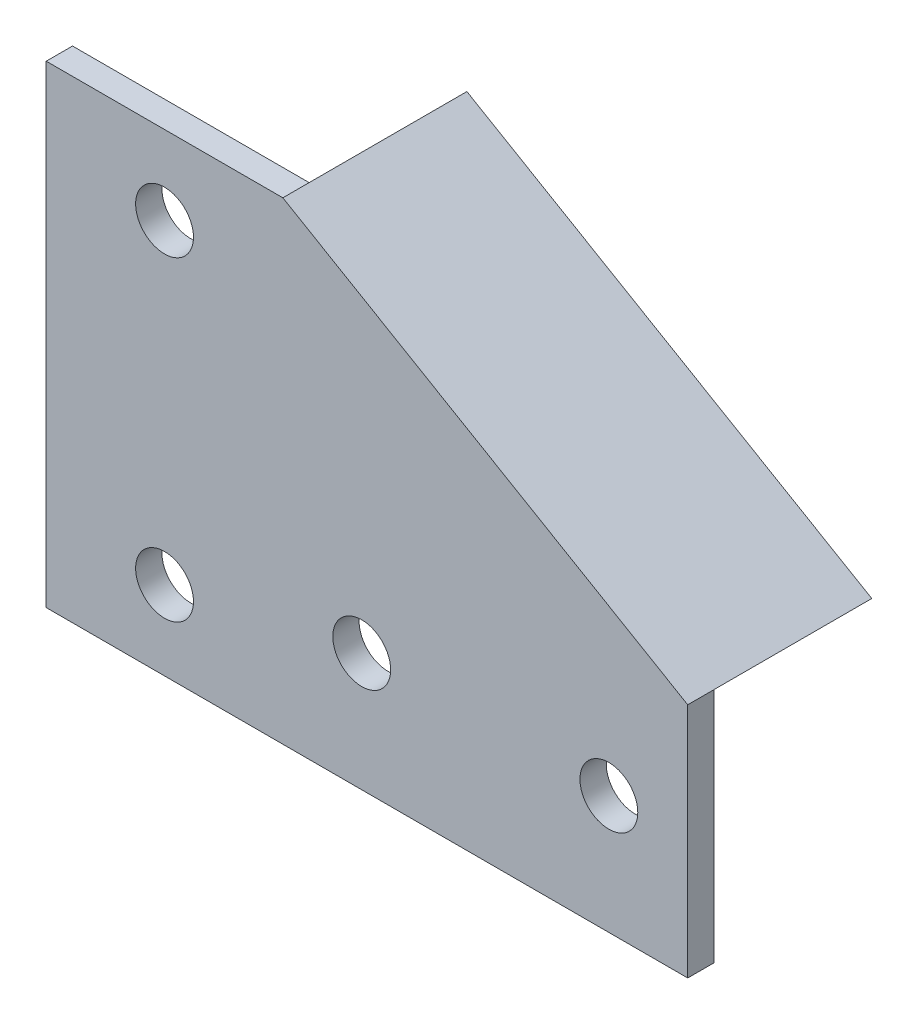
ISO-10303-21;
HEADER;
FILE_DESCRIPTION(('STEP AP214'),'2;1');
FILE_NAME('part.step','',(''),(''),'','','');
FILE_SCHEMA(('AUTOMOTIVE_DESIGN { 1 0 10303 214 1 1 1 1 }'));
ENDSEC;
DATA;
#1=APPLICATION_CONTEXT('core data for automotive mechanical design processes');
#2=APPLICATION_PROTOCOL_DEFINITION('international standard','automotive_design',2000,#1);
#3=PRODUCT_CONTEXT('',#1,'mechanical');
#4=PRODUCT('Part','Part','',(#3));
#5=PRODUCT_RELATED_PRODUCT_CATEGORY('part','',(#4));
#6=PRODUCT_DEFINITION_FORMATION('','',#4);
#7=PRODUCT_DEFINITION_CONTEXT('part definition',#1,'design');
#8=PRODUCT_DEFINITION('design','',#6,#7);
#9=PRODUCT_DEFINITION_SHAPE('','',#8);
#10=(LENGTH_UNIT() NAMED_UNIT(*) SI_UNIT(.MILLI.,.METRE.));
#11=(NAMED_UNIT(*) PLANE_ANGLE_UNIT() SI_UNIT($,.RADIAN.));
#12=(NAMED_UNIT(*) SI_UNIT($,.STERADIAN.) SOLID_ANGLE_UNIT());
#13=UNCERTAINTY_MEASURE_WITH_UNIT(LENGTH_MEASURE(1.E-05),#10,'distance_accuracy_value','');
#14=(GEOMETRIC_REPRESENTATION_CONTEXT(3) GLOBAL_UNCERTAINTY_ASSIGNED_CONTEXT((#13)) GLOBAL_UNIT_ASSIGNED_CONTEXT((#10,
#11,#12)) REPRESENTATION_CONTEXT('',''));
#15=CARTESIAN_POINT('',(0.,0.,0.));
#16=DIRECTION('',(0.,0.,1.));
#17=DIRECTION('',(1.,0.,0.));
#18=AXIS2_PLACEMENT_3D('',#15,#16,#17);
#19=CARTESIAN_POINT('',(0.,0.,0.));
#20=DIRECTION('',(0.,0.,-1.));
#21=DIRECTION('',(-1.,0.,0.));
#22=AXIS2_PLACEMENT_3D('',#19,#20,#21);
#23=PLANE('',#22);
#24=DIRECTION('',(0.,-1.,0.));
#25=VECTOR('',#24,1.);
#26=CARTESIAN_POINT('',(71.,27.5,0.));
#27=LINE('',#26,#25);
#28=CARTESIAN_POINT('',(71.,27.5,0.));
#29=VERTEX_POINT('',#28);
#30=CARTESIAN_POINT('',(71.,17.5,0.));
#31=VERTEX_POINT('',#30);
#32=EDGE_CURVE('E168',#29,#31,#27,.T.);
#33=ORIENTED_EDGE('',*,*,#32,.T.);
#34=DIRECTION('',(1.,0.,0.));
#35=VECTOR('',#34,1.);
#36=CARTESIAN_POINT('',(71.,17.5,0.));
#37=LINE('',#36,#35);
#38=CARTESIAN_POINT('',(96.,17.5,0.));
#39=VERTEX_POINT('',#38);
#40=EDGE_CURVE('E171',#31,#39,#37,.T.);
#41=ORIENTED_EDGE('',*,*,#40,.T.);
#42=DIRECTION('',(0.,1.,0.));
#43=VECTOR('',#42,1.);
#44=CARTESIAN_POINT('',(96.,27.5,0.));
#45=LINE('',#44,#43);
#46=CARTESIAN_POINT('',(96.,27.5,0.));
#47=VERTEX_POINT('',#46);
#48=EDGE_CURVE('E177',#39,#47,#45,.T.);
#49=ORIENTED_EDGE('',*,*,#48,.T.);
#50=DIRECTION('',(-1.,0.,0.));
#51=VECTOR('',#50,1.);
#52=CARTESIAN_POINT('',(71.,27.5,0.));
#53=LINE('',#52,#51);
#54=EDGE_CURVE('E179',#47,#29,#53,.T.);
#55=ORIENTED_EDGE('',*,*,#54,.T.);
#56=EDGE_LOOP('',(#33,#41,#49,#55));
#57=FACE_BOUND('',#56,.T.);
#58=DIRECTION('',(0.,-1.,0.));
#59=VECTOR('',#58,1.);
#60=CARTESIAN_POINT('',(17.5,64.,0.));
#61=LINE('',#60,#59);
#62=CARTESIAN_POINT('',(17.5,64.,0.));
#63=VERTEX_POINT('',#62);
#64=CARTESIAN_POINT('',(17.5,26.,0.));
#65=VERTEX_POINT('',#64);
#66=EDGE_CURVE('E182',#63,#65,#61,.T.);
#67=ORIENTED_EDGE('',*,*,#66,.T.);
#68=DIRECTION('',(1.,0.,0.));
#69=VECTOR('',#68,1.);
#70=CARTESIAN_POINT('',(17.5,26.,0.));
#71=LINE('',#70,#69);
#72=CARTESIAN_POINT('',(27.5,26.,0.));
#73=VERTEX_POINT('',#72);
#74=EDGE_CURVE('E184',#65,#73,#71,.T.);
#75=ORIENTED_EDGE('',*,*,#74,.T.);
#76=DIRECTION('',(0.,1.,0.));
#77=VECTOR('',#76,1.);
#78=CARTESIAN_POINT('',(27.5,64.,0.));
#79=LINE('',#78,#77);
#80=CARTESIAN_POINT('',(27.5,64.,0.));
#81=VERTEX_POINT('',#80);
#82=EDGE_CURVE('E187',#73,#81,#79,.T.);
#83=ORIENTED_EDGE('',*,*,#82,.T.);
#84=DIRECTION('',(-1.,0.,0.));
#85=VECTOR('',#84,1.);
#86=CARTESIAN_POINT('',(17.5,64.,0.));
#87=LINE('',#86,#85);
#88=EDGE_CURVE('E189',#81,#63,#87,.T.);
#89=ORIENTED_EDGE('',*,*,#88,.T.);
#90=EDGE_LOOP('',(#67,#75,#83,#89));
#91=FACE_BOUND('',#90,.T.);
#92=CARTESIAN_POINT('',(107.,22.5,0.));
#93=DIRECTION('',(0.,0.,1.));
#94=DIRECTION('',(1.,0.,0.));
#95=AXIS2_PLACEMENT_3D('',#92,#93,#94);
#96=CIRCLE('',#95,5.5);
#97=CARTESIAN_POINT('',(112.5,22.5,0.));
#98=VERTEX_POINT('',#97);
#99=EDGE_CURVE('E195',#98,#98,#96,.T.);
#100=ORIENTED_EDGE('',*,*,#99,.T.);
#101=EDGE_LOOP('',(#100));
#102=FACE_BOUND('',#101,.T.);
#103=CARTESIAN_POINT('',(22.5,75.,0.));
#104=DIRECTION('',(0.,0.,1.));
#105=DIRECTION('',(1.,0.,0.));
#106=AXIS2_PLACEMENT_3D('',#103,#104,#105);
#107=CIRCLE('',#106,5.5);
#108=CARTESIAN_POINT('',(28.,75.,0.));
#109=VERTEX_POINT('',#108);
#110=EDGE_CURVE('E209',#109,#109,#107,.T.);
#111=ORIENTED_EDGE('',*,*,#110,.T.);
#112=EDGE_LOOP('',(#111));
#113=FACE_BOUND('',#112,.T.);
#114=CARTESIAN_POINT('',(22.5,15.,0.));
#115=DIRECTION('',(0.,0.,1.));
#116=DIRECTION('',(1.,0.,0.));
#117=AXIS2_PLACEMENT_3D('',#114,#115,#116);
#118=CIRCLE('',#117,5.5);
#119=CARTESIAN_POINT('',(28.,15.,0.));
#120=VERTEX_POINT('',#119);
#121=EDGE_CURVE('E203',#120,#120,#118,.T.);
#122=ORIENTED_EDGE('',*,*,#121,.T.);
#123=EDGE_LOOP('',(#122));
#124=FACE_BOUND('',#123,.T.);
#125=CARTESIAN_POINT('',(60.,22.5,0.));
#126=DIRECTION('',(0.,0.,1.));
#127=DIRECTION('',(1.,0.,0.));
#128=AXIS2_PLACEMENT_3D('',#125,#126,#127);
#129=CIRCLE('',#128,5.49999999999999);
#130=CARTESIAN_POINT('',(65.5,22.5,0.));
#131=VERTEX_POINT('',#130);
#132=EDGE_CURVE('E196',#131,#131,#129,.T.);
#133=ORIENTED_EDGE('',*,*,#132,.T.);
#134=EDGE_LOOP('',(#133));
#135=FACE_BOUND('',#134,.T.);
#136=DIRECTION('',(0.,1.,0.));
#137=VECTOR('',#136,1.);
#138=CARTESIAN_POINT('',(45.,45.,0.));
#139=LINE('',#138,#137);
#140=CARTESIAN_POINT('',(45.,50.,0.));
#141=VERTEX_POINT('',#140);
#142=CARTESIAN_POINT('',(45.,90.,0.));
#143=VERTEX_POINT('',#142);
#144=EDGE_CURVE('E161',#141,#143,#139,.T.);
#145=ORIENTED_EDGE('',*,*,#144,.F.);
#146=DIRECTION('',(-0.707106781186551,0.707106781186544,0.));
#147=VECTOR('',#146,1.);
#148=CARTESIAN_POINT('',(45.,50.,0.));
#149=LINE('',#148,#147);
#150=CARTESIAN_POINT('',(50.0000000000001,45.,0.));
#151=VERTEX_POINT('',#150);
#152=EDGE_CURVE('E11',#141,#151,#149,.F.);
#153=ORIENTED_EDGE('',*,*,#152,.T.);
#154=DIRECTION('',(-1.,0.,0.));
#155=VECTOR('',#154,1.);
#156=CARTESIAN_POINT('',(122.,45.,0.));
#157=LINE('',#156,#155);
#158=CARTESIAN_POINT('',(122.,45.,0.));
#159=VERTEX_POINT('',#158);
#160=EDGE_CURVE('E415',#159,#151,#157,.T.);
#161=ORIENTED_EDGE('',*,*,#160,.F.);
#162=DIRECTION('',(0.,1.,0.));
#163=VECTOR('',#162,1.);
#164=CARTESIAN_POINT('',(122.,45.,0.));
#165=LINE('',#164,#163);
#166=CARTESIAN_POINT('',(122.,0.,0.));
#167=VERTEX_POINT('',#166);
#168=EDGE_CURVE('E233',#167,#159,#165,.T.);
#169=ORIENTED_EDGE('',*,*,#168,.F.);
#170=DIRECTION('',(1.,0.,0.));
#171=VECTOR('',#170,1.);
#172=CARTESIAN_POINT('',(122.,0.,0.));
#173=LINE('',#172,#171);
#174=CARTESIAN_POINT('',(0.,0.,0.));
#175=VERTEX_POINT('',#174);
#176=EDGE_CURVE('E215',#175,#167,#173,.T.);
#177=ORIENTED_EDGE('',*,*,#176,.F.);
#178=DIRECTION('',(0.,-1.,0.));
#179=VECTOR('',#178,1.);
#180=CARTESIAN_POINT('',(0.,0.,0.));
#181=LINE('',#180,#179);
#182=CARTESIAN_POINT('',(0.,90.,0.));
#183=VERTEX_POINT('',#182);
#184=EDGE_CURVE('E222',#183,#175,#181,.T.);
#185=ORIENTED_EDGE('',*,*,#184,.F.);
#186=DIRECTION('',(-1.,0.,0.));
#187=VECTOR('',#186,1.);
#188=CARTESIAN_POINT('',(0.,90.,0.));
#189=LINE('',#188,#187);
#190=EDGE_CURVE('E236',#143,#183,#189,.T.);
#191=ORIENTED_EDGE('',*,*,#190,.F.);
#192=EDGE_LOOP('',(#145,#153,#161,#169,#177,#185,#191));
#193=FACE_BOUND('',#192,.T.);
#194=ADVANCED_FACE('F35',(#57,#91,#102,#113,#124,#135,#193),#23,.T.);
#195=CARTESIAN_POINT('',(0.,0.,5.));
#196=DIRECTION('',(0.,0.,-1.));
#197=DIRECTION('',(-1.,0.,0.));
#198=AXIS2_PLACEMENT_3D('',#195,#196,#197);
#199=PLANE('',#198);
#200=DIRECTION('',(1.,0.,0.));
#201=VECTOR('',#200,1.);
#202=CARTESIAN_POINT('',(122.,0.,5.));
#203=LINE('',#202,#201);
#204=CARTESIAN_POINT('',(0.,0.,5.));
#205=VERTEX_POINT('',#204);
#206=CARTESIAN_POINT('',(122.,0.,5.));
#207=VERTEX_POINT('',#206);
#208=EDGE_CURVE('E218',#205,#207,#203,.T.);
#209=ORIENTED_EDGE('',*,*,#208,.T.);
#210=DIRECTION('',(0.,1.,0.));
#211=VECTOR('',#210,1.);
#212=CARTESIAN_POINT('',(122.,45.,5.));
#213=LINE('',#212,#211);
#214=CARTESIAN_POINT('',(122.,45.,5.));
#215=VERTEX_POINT('',#214);
#216=EDGE_CURVE('E221',#207,#215,#213,.T.);
#217=ORIENTED_EDGE('',*,*,#216,.T.);
#218=DIRECTION('',(-0.863371944126605,0.504568019294769,0.));
#219=VECTOR('',#218,1.);
#220=CARTESIAN_POINT('',(45.,90.,5.));
#221=LINE('',#220,#219);
#222=CARTESIAN_POINT('',(45.,90.,5.));
#223=VERTEX_POINT('',#222);
#224=EDGE_CURVE('E224',#215,#223,#221,.T.);
#225=ORIENTED_EDGE('',*,*,#224,.T.);
#226=DIRECTION('',(-1.,0.,0.));
#227=VECTOR('',#226,1.);
#228=CARTESIAN_POINT('',(0.,90.,5.));
#229=LINE('',#228,#227);
#230=CARTESIAN_POINT('',(0.,90.,5.));
#231=VERTEX_POINT('',#230);
#232=EDGE_CURVE('E226',#223,#231,#229,.T.);
#233=ORIENTED_EDGE('',*,*,#232,.T.);
#234=DIRECTION('',(0.,-1.,0.));
#235=VECTOR('',#234,1.);
#236=CARTESIAN_POINT('',(0.,0.,5.));
#237=LINE('',#236,#235);
#238=EDGE_CURVE('E228',#231,#205,#237,.T.);
#239=ORIENTED_EDGE('',*,*,#238,.T.);
#240=EDGE_LOOP('',(#209,#217,#225,#233,#239));
#241=FACE_BOUND('',#240,.T.);
#242=CARTESIAN_POINT('',(22.5,75.,5.));
#243=DIRECTION('',(0.,0.,1.));
#244=DIRECTION('',(1.,0.,0.));
#245=AXIS2_PLACEMENT_3D('',#242,#243,#244);
#246=CIRCLE('',#245,5.5);
#247=CARTESIAN_POINT('',(28.,75.,5.));
#248=VERTEX_POINT('',#247);
#249=EDGE_CURVE('E212',#248,#248,#246,.T.);
#250=ORIENTED_EDGE('',*,*,#249,.F.);
#251=EDGE_LOOP('',(#250));
#252=FACE_BOUND('',#251,.T.);
#253=CARTESIAN_POINT('',(22.5,15.,5.));
#254=DIRECTION('',(0.,0.,1.));
#255=DIRECTION('',(1.,0.,0.));
#256=AXIS2_PLACEMENT_3D('',#253,#254,#255);
#257=CIRCLE('',#256,5.5);
#258=CARTESIAN_POINT('',(28.,15.,5.));
#259=VERTEX_POINT('',#258);
#260=EDGE_CURVE('E206',#259,#259,#257,.T.);
#261=ORIENTED_EDGE('',*,*,#260,.F.);
#262=EDGE_LOOP('',(#261));
#263=FACE_BOUND('',#262,.T.);
#264=CARTESIAN_POINT('',(107.,22.5,5.));
#265=DIRECTION('',(0.,0.,1.));
#266=DIRECTION('',(1.,0.,0.));
#267=AXIS2_PLACEMENT_3D('',#264,#265,#266);
#268=CIRCLE('',#267,5.5);
#269=CARTESIAN_POINT('',(112.5,22.5,5.));
#270=VERTEX_POINT('',#269);
#271=EDGE_CURVE('E200',#270,#270,#268,.T.);
#272=ORIENTED_EDGE('',*,*,#271,.F.);
#273=EDGE_LOOP('',(#272));
#274=FACE_BOUND('',#273,.T.);
#275=CARTESIAN_POINT('',(60.,22.5,5.));
#276=DIRECTION('',(0.,0.,1.));
#277=DIRECTION('',(1.,0.,0.));
#278=AXIS2_PLACEMENT_3D('',#275,#276,#277);
#279=CIRCLE('',#278,5.49999999999999);
#280=CARTESIAN_POINT('',(65.5,22.5,5.));
#281=VERTEX_POINT('',#280);
#282=EDGE_CURVE('E192',#281,#281,#279,.T.);
#283=ORIENTED_EDGE('',*,*,#282,.F.);
#284=EDGE_LOOP('',(#283));
#285=FACE_BOUND('',#284,.T.);
#286=ADVANCED_FACE('F309',(#241,#252,#263,#274,#285),#199,.F.);
#287=CARTESIAN_POINT('',(122.,0.,5.));
#288=DIRECTION('',(0.,1.,0.));
#289=DIRECTION('',(-1.,0.,0.));
#290=AXIS2_PLACEMENT_3D('',#287,#288,#289);
#291=PLANE('',#290);
#292=ORIENTED_EDGE('',*,*,#176,.T.);
#293=DIRECTION('',(0.,0.,-1.));
#294=VECTOR('',#293,1.);
#295=CARTESIAN_POINT('',(122.,0.,5.));
#296=LINE('',#295,#294);
#297=EDGE_CURVE('E248',#207,#167,#296,.T.);
#298=ORIENTED_EDGE('',*,*,#297,.F.);
#299=ORIENTED_EDGE('',*,*,#208,.F.);
#300=DIRECTION('',(0.,0.,-1.));
#301=VECTOR('',#300,1.);
#302=CARTESIAN_POINT('',(0.,0.,5.));
#303=LINE('',#302,#301);
#304=EDGE_CURVE('E230',#205,#175,#303,.T.);
#305=ORIENTED_EDGE('',*,*,#304,.T.);
#306=EDGE_LOOP('',(#292,#298,#299,#305));
#307=FACE_BOUND('',#306,.T.);
#308=ADVANCED_FACE('F315',(#307),#291,.F.);
#309=CARTESIAN_POINT('',(122.,45.,5.));
#310=DIRECTION('',(-1.,0.,0.));
#311=DIRECTION('',(0.,0.,1.));
#312=AXIS2_PLACEMENT_3D('',#309,#310,#311);
#313=PLANE('',#312);
#314=ORIENTED_EDGE('',*,*,#168,.T.);
#315=DIRECTION('',(0.,0.,-1.));
#316=VECTOR('',#315,1.);
#317=CARTESIAN_POINT('',(122.,45.,5.));
#318=LINE('',#317,#316);
#319=EDGE_CURVE('E167',#215,#159,#318,.T.);
#320=ORIENTED_EDGE('',*,*,#319,.F.);
#321=ORIENTED_EDGE('',*,*,#216,.F.);
#322=ORIENTED_EDGE('',*,*,#297,.T.);
#323=EDGE_LOOP('',(#314,#320,#321,#322));
#324=FACE_BOUND('',#323,.T.);
#325=ADVANCED_FACE('F332',(#324),#313,.F.);
#326=CARTESIAN_POINT('',(45.,90.,5.));
#327=DIRECTION('',(-0.504568019294769,-0.863371944126605,0.));
#328=DIRECTION('',(0.863371944126605,-0.504568019294769,0.));
#329=AXIS2_PLACEMENT_3D('',#326,#327,#328);
#330=PLANE('',#329);
#331=ORIENTED_EDGE('',*,*,#319,.T.);
#332=DIRECTION('',(0.,0.,1.));
#333=VECTOR('',#332,1.);
#334=CARTESIAN_POINT('',(122.,45.,-30.));
#335=LINE('',#334,#333);
#336=CARTESIAN_POINT('',(122.,45.,-30.));
#337=VERTEX_POINT('',#336);
#338=EDGE_CURVE('E149',#337,#159,#335,.T.);
#339=ORIENTED_EDGE('',*,*,#338,.F.);
#340=DIRECTION('',(0.863371944126605,-0.504568019294769,0.));
#341=VECTOR('',#340,1.);
#342=CARTESIAN_POINT('',(45.,90.,-30.));
#343=LINE('',#342,#341);
#344=CARTESIAN_POINT('',(45.,90.,-30.));
#345=VERTEX_POINT('',#344);
#346=EDGE_CURVE('E153',#345,#337,#343,.T.);
#347=ORIENTED_EDGE('',*,*,#346,.F.);
#348=DIRECTION('',(0.,0.,1.));
#349=VECTOR('',#348,1.);
#350=CARTESIAN_POINT('',(45.,90.,-30.));
#351=LINE('',#350,#349);
#352=EDGE_CURVE('E169',#345,#143,#351,.T.);
#353=ORIENTED_EDGE('',*,*,#352,.T.);
#354=DIRECTION('',(0.,0.,-1.));
#355=VECTOR('',#354,1.);
#356=CARTESIAN_POINT('',(45.,90.,5.));
#357=LINE('',#356,#355);
#358=EDGE_CURVE('E244',#223,#143,#357,.T.);
#359=ORIENTED_EDGE('',*,*,#358,.F.);
#360=ORIENTED_EDGE('',*,*,#224,.F.);
#361=EDGE_LOOP('',(#331,#339,#347,#353,#359,#360));
#362=FACE_BOUND('',#361,.T.);
#363=ADVANCED_FACE('F164',(#362),#330,.F.);
#364=CARTESIAN_POINT('',(0.,90.,5.));
#365=DIRECTION('',(0.,-1.,0.));
#366=DIRECTION('',(0.,0.,-1.));
#367=AXIS2_PLACEMENT_3D('',#364,#365,#366);
#368=PLANE('',#367);
#369=ORIENTED_EDGE('',*,*,#190,.T.);
#370=DIRECTION('',(0.,0.,-1.));
#371=VECTOR('',#370,1.);
#372=CARTESIAN_POINT('',(0.,90.,5.));
#373=LINE('',#372,#371);
#374=EDGE_CURVE('E241',#231,#183,#373,.T.);
#375=ORIENTED_EDGE('',*,*,#374,.F.);
#376=ORIENTED_EDGE('',*,*,#232,.F.);
#377=ORIENTED_EDGE('',*,*,#358,.T.);
#378=EDGE_LOOP('',(#369,#375,#376,#377));
#379=FACE_BOUND('',#378,.T.);
#380=ADVANCED_FACE('F325',(#379),#368,.F.);
#381=CARTESIAN_POINT('',(0.,0.,5.));
#382=DIRECTION('',(1.,0.,0.));
#383=DIRECTION('',(0.,0.,-1.));
#384=AXIS2_PLACEMENT_3D('',#381,#382,#383);
#385=PLANE('',#384);
#386=ORIENTED_EDGE('',*,*,#184,.T.);
#387=ORIENTED_EDGE('',*,*,#304,.F.);
#388=ORIENTED_EDGE('',*,*,#238,.F.);
#389=ORIENTED_EDGE('',*,*,#374,.T.);
#390=EDGE_LOOP('',(#386,#387,#388,#389));
#391=FACE_BOUND('',#390,.T.);
#392=ADVANCED_FACE('F321',(#391),#385,.F.);
#393=CARTESIAN_POINT('',(22.5,75.,5.));
#394=DIRECTION('',(0.,0.,-1.));
#395=DIRECTION('',(-1.,0.,0.));
#396=AXIS2_PLACEMENT_3D('',#393,#394,#395);
#397=CYLINDRICAL_SURFACE('',#396,5.5);
#398=ORIENTED_EDGE('',*,*,#249,.T.);
#399=EDGE_LOOP('',(#398));
#400=FACE_BOUND('',#399,.T.);
#401=ORIENTED_EDGE('',*,*,#110,.F.);
#402=EDGE_LOOP('',(#401));
#403=FACE_BOUND('',#402,.T.);
#404=ADVANCED_FACE('F324',(#400,#403),#397,.F.);
#405=CARTESIAN_POINT('',(22.5,15.,5.));
#406=DIRECTION('',(0.,0.,-1.));
#407=DIRECTION('',(-1.,0.,0.));
#408=AXIS2_PLACEMENT_3D('',#405,#406,#407);
#409=CYLINDRICAL_SURFACE('',#408,5.5);
#410=ORIENTED_EDGE('',*,*,#260,.T.);
#411=EDGE_LOOP('',(#410));
#412=FACE_BOUND('',#411,.T.);
#413=ORIENTED_EDGE('',*,*,#121,.F.);
#414=EDGE_LOOP('',(#413));
#415=FACE_BOUND('',#414,.T.);
#416=ADVANCED_FACE('F397',(#412,#415),#409,.F.);
#417=CARTESIAN_POINT('',(107.,22.5,5.));
#418=DIRECTION('',(0.,0.,-1.));
#419=DIRECTION('',(-1.,0.,0.));
#420=AXIS2_PLACEMENT_3D('',#417,#418,#419);
#421=CYLINDRICAL_SURFACE('',#420,5.5);
#422=ORIENTED_EDGE('',*,*,#271,.T.);
#423=EDGE_LOOP('',(#422));
#424=FACE_BOUND('',#423,.T.);
#425=ORIENTED_EDGE('',*,*,#99,.F.);
#426=EDGE_LOOP('',(#425));
#427=FACE_BOUND('',#426,.T.);
#428=ADVANCED_FACE('F375',(#424,#427),#421,.F.);
#429=CARTESIAN_POINT('',(60.,22.5,5.));
#430=DIRECTION('',(0.,0.,-1.));
#431=DIRECTION('',(-1.,0.,0.));
#432=AXIS2_PLACEMENT_3D('',#429,#430,#431);
#433=CYLINDRICAL_SURFACE('',#432,5.49999999999999);
#434=ORIENTED_EDGE('',*,*,#282,.T.);
#435=EDGE_LOOP('',(#434));
#436=FACE_BOUND('',#435,.T.);
#437=ORIENTED_EDGE('',*,*,#132,.F.);
#438=EDGE_LOOP('',(#437));
#439=FACE_BOUND('',#438,.T.);
#440=ADVANCED_FACE('F370',(#436,#439),#433,.F.);
#441=CARTESIAN_POINT('',(17.5,64.,0.));
#442=DIRECTION('',(-0.984807753012208,0.,-0.173648177666931));
#443=DIRECTION('',(-0.173648177666931,0.,0.984807753012208));
#444=AXIS2_PLACEMENT_3D('',#441,#442,#443);
#445=PLANE('',#444);
#446=ORIENTED_EDGE('',*,*,#66,.F.);
#447=DIRECTION('',(-0.171087869746036,0.171087869746036,0.970287525247814));
#448=VECTOR('',#447,1.);
#449=CARTESIAN_POINT('',(17.5,64.,0.));
#450=LINE('',#449,#448);
#451=CARTESIAN_POINT('',(18.5579618842508,62.9420381157492,-6.));
#452=VERTEX_POINT('',#451);
#453=EDGE_CURVE('E199',#452,#63,#450,.T.);
#454=ORIENTED_EDGE('',*,*,#453,.F.);
#455=DIRECTION('',(0.,-1.,0.));
#456=VECTOR('',#455,1.);
#457=CARTESIAN_POINT('',(18.5579618842508,0.,-6.));
#458=LINE('',#457,#456);
#459=CARTESIAN_POINT('',(18.5579618842508,27.0579618842508,-6.));
#460=VERTEX_POINT('',#459);
#461=EDGE_CURVE('E191',#452,#460,#458,.T.);
#462=ORIENTED_EDGE('',*,*,#461,.T.);
#463=DIRECTION('',(-0.171087869746036,-0.171087869746036,0.970287525247814));
#464=VECTOR('',#463,1.);
#465=CARTESIAN_POINT('',(18.612300248621,27.112300248621,-6.30816817796045));
#466=LINE('',#465,#464);
#467=EDGE_CURVE('E274',#460,#65,#466,.T.);
#468=ORIENTED_EDGE('',*,*,#467,.T.);
#469=EDGE_LOOP('',(#446,#454,#462,#468));
#470=FACE_BOUND('',#469,.T.);
#471=ADVANCED_FACE('F367',(#470),#445,.T.);
#472=CARTESIAN_POINT('',(17.5,64.,0.));
#473=DIRECTION('',(0.,0.984807753012208,-0.173648177666931));
#474=DIRECTION('',(0.,0.173648177666931,0.984807753012208));
#475=AXIS2_PLACEMENT_3D('',#472,#473,#474);
#476=PLANE('',#475);
#477=ORIENTED_EDGE('',*,*,#88,.F.);
#478=DIRECTION('',(0.171087869746036,0.171087869746036,0.970287525247814));
#479=VECTOR('',#478,1.);
#480=CARTESIAN_POINT('',(27.5,64.,0.));
#481=LINE('',#480,#479);
#482=CARTESIAN_POINT('',(26.4420381157492,62.9420381157492,-6.));
#483=VERTEX_POINT('',#482);
#484=EDGE_CURVE('E281',#483,#81,#481,.T.);
#485=ORIENTED_EDGE('',*,*,#484,.F.);
#486=DIRECTION('',(-1.,0.,0.));
#487=VECTOR('',#486,1.);
#488=CARTESIAN_POINT('',(0.,62.9420381157492,-6.));
#489=LINE('',#488,#487);
#490=EDGE_CURVE('E278',#483,#452,#489,.T.);
#491=ORIENTED_EDGE('',*,*,#490,.T.);
#492=ORIENTED_EDGE('',*,*,#453,.T.);
#493=EDGE_LOOP('',(#477,#485,#491,#492));
#494=FACE_BOUND('',#493,.T.);
#495=ADVANCED_FACE('F364',(#494),#476,.T.);
#496=CARTESIAN_POINT('',(27.5,64.,0.));
#497=DIRECTION('',(0.984807753012208,0.,-0.173648177666931));
#498=DIRECTION('',(-0.173648177666931,0.,-0.984807753012208));
#499=AXIS2_PLACEMENT_3D('',#496,#497,#498);
#500=PLANE('',#499);
#501=ORIENTED_EDGE('',*,*,#82,.F.);
#502=DIRECTION('',(0.171087869746036,-0.171087869746036,0.970287525247814));
#503=VECTOR('',#502,1.);
#504=CARTESIAN_POINT('',(27.2072894082576,26.2927105917423,-1.66004425735802));
#505=LINE('',#504,#503);
#506=CARTESIAN_POINT('',(26.4420381157492,27.0579618842508,-6.));
#507=VERTEX_POINT('',#506);
#508=EDGE_CURVE('E277',#507,#73,#505,.T.);
#509=ORIENTED_EDGE('',*,*,#508,.F.);
#510=DIRECTION('',(0.,1.,0.));
#511=VECTOR('',#510,1.);
#512=CARTESIAN_POINT('',(26.4420381157492,0.,-6.));
#513=LINE('',#512,#511);
#514=EDGE_CURVE('E289',#507,#483,#513,.T.);
#515=ORIENTED_EDGE('',*,*,#514,.T.);
#516=ORIENTED_EDGE('',*,*,#484,.T.);
#517=EDGE_LOOP('',(#501,#509,#515,#516));
#518=FACE_BOUND('',#517,.T.);
#519=ADVANCED_FACE('F360',(#518),#500,.T.);
#520=CARTESIAN_POINT('',(17.5,26.,0.));
#521=DIRECTION('',(0.,-0.984807753012208,-0.173648177666931));
#522=DIRECTION('',(0.,0.173648177666931,-0.984807753012208));
#523=AXIS2_PLACEMENT_3D('',#520,#521,#522);
#524=PLANE('',#523);
#525=ORIENTED_EDGE('',*,*,#74,.F.);
#526=ORIENTED_EDGE('',*,*,#467,.F.);
#527=DIRECTION('',(1.,0.,0.));
#528=VECTOR('',#527,1.);
#529=CARTESIAN_POINT('',(0.,27.0579618842508,-6.));
#530=LINE('',#529,#528);
#531=EDGE_CURVE('E286',#460,#507,#530,.T.);
#532=ORIENTED_EDGE('',*,*,#531,.T.);
#533=ORIENTED_EDGE('',*,*,#508,.T.);
#534=EDGE_LOOP('',(#525,#526,#532,#533));
#535=FACE_BOUND('',#534,.T.);
#536=ADVANCED_FACE('F357',(#535),#524,.T.);
#537=CARTESIAN_POINT('',(0.,0.,-6.));
#538=DIRECTION('',(0.,0.,1.));
#539=DIRECTION('',(1.,0.,0.));
#540=AXIS2_PLACEMENT_3D('',#537,#538,#539);
#541=PLANE('',#540);
#542=ORIENTED_EDGE('',*,*,#461,.F.);
#543=ORIENTED_EDGE('',*,*,#490,.F.);
#544=ORIENTED_EDGE('',*,*,#514,.F.);
#545=ORIENTED_EDGE('',*,*,#531,.F.);
#546=EDGE_LOOP('',(#542,#543,#544,#545));
#547=FACE_BOUND('',#546,.T.);
#548=ADVANCED_FACE('F351',(#547),#541,.F.);
#549=CARTESIAN_POINT('',(71.,27.5,0.));
#550=DIRECTION('',(-0.984807753012208,0.,-0.173648177666931));
#551=DIRECTION('',(-0.173648177666931,0.,0.984807753012208));
#552=AXIS2_PLACEMENT_3D('',#549,#550,#551);
#553=PLANE('',#552);
#554=ORIENTED_EDGE('',*,*,#32,.F.);
#555=DIRECTION('',(-0.171087869746036,0.171087869746036,0.970287525247814));
#556=VECTOR('',#555,1.);
#557=CARTESIAN_POINT('',(71.,27.5,0.));
#558=LINE('',#557,#556);
#559=CARTESIAN_POINT('',(72.0579618842508,26.4420381157492,-6.));
#560=VERTEX_POINT('',#559);
#561=EDGE_CURVE('E185',#560,#29,#558,.T.);
#562=ORIENTED_EDGE('',*,*,#561,.F.);
#563=DIRECTION('',(0.,-1.,0.));
#564=VECTOR('',#563,1.);
#565=CARTESIAN_POINT('',(72.0579618842508,0.,-6.));
#566=LINE('',#565,#564);
#567=CARTESIAN_POINT('',(72.0579618842508,18.5579618842508,-6.));
#568=VERTEX_POINT('',#567);
#569=EDGE_CURVE('E181',#560,#568,#566,.T.);
#570=ORIENTED_EDGE('',*,*,#569,.T.);
#571=DIRECTION('',(-0.171087869746036,-0.171087869746036,0.970287525247814));
#572=VECTOR('',#571,1.);
#573=CARTESIAN_POINT('',(71.2927105917424,17.7927105917424,-1.66004425735801));
#574=LINE('',#573,#572);
#575=EDGE_CURVE('E260',#568,#31,#574,.T.);
#576=ORIENTED_EDGE('',*,*,#575,.T.);
#577=EDGE_LOOP('',(#554,#562,#570,#576));
#578=FACE_BOUND('',#577,.T.);
#579=ADVANCED_FACE('F343',(#578),#553,.T.);
#580=CARTESIAN_POINT('',(71.,27.5,0.));
#581=DIRECTION('',(0.,0.984807753012208,-0.173648177666931));
#582=DIRECTION('',(0.,0.173648177666931,0.984807753012208));
#583=AXIS2_PLACEMENT_3D('',#580,#581,#582);
#584=PLANE('',#583);
#585=ORIENTED_EDGE('',*,*,#54,.F.);
#586=DIRECTION('',(0.171087869746036,0.171087869746036,0.970287525247814));
#587=VECTOR('',#586,1.);
#588=CARTESIAN_POINT('',(96.,27.5,0.));
#589=LINE('',#588,#587);
#590=CARTESIAN_POINT('',(94.9420381157492,26.4420381157492,-6.));
#591=VERTEX_POINT('',#590);
#592=EDGE_CURVE('E252',#591,#47,#589,.T.);
#593=ORIENTED_EDGE('',*,*,#592,.F.);
#594=DIRECTION('',(-1.,0.,0.));
#595=VECTOR('',#594,1.);
#596=CARTESIAN_POINT('',(0.,26.4420381157492,-6.));
#597=LINE('',#596,#595);
#598=EDGE_CURVE('E263',#591,#560,#597,.T.);
#599=ORIENTED_EDGE('',*,*,#598,.T.);
#600=ORIENTED_EDGE('',*,*,#561,.T.);
#601=EDGE_LOOP('',(#585,#593,#599,#600));
#602=FACE_BOUND('',#601,.T.);
#603=ADVANCED_FACE('F339',(#602),#584,.T.);
#604=CARTESIAN_POINT('',(96.,27.5,0.));
#605=DIRECTION('',(0.984807753012208,0.,-0.173648177666931));
#606=DIRECTION('',(-0.173648177666931,0.,-0.984807753012208));
#607=AXIS2_PLACEMENT_3D('',#604,#605,#606);
#608=PLANE('',#607);
#609=ORIENTED_EDGE('',*,*,#48,.F.);
#610=DIRECTION('',(0.171087869746036,-0.171087869746036,0.970287525247814));
#611=VECTOR('',#610,1.);
#612=CARTESIAN_POINT('',(95.2682235206441,18.2317764793559,-4.15011064339503));
#613=LINE('',#612,#611);
#614=CARTESIAN_POINT('',(94.9420381157492,18.5579618842508,-6.));
#615=VERTEX_POINT('',#614);
#616=EDGE_CURVE('E255',#615,#39,#613,.T.);
#617=ORIENTED_EDGE('',*,*,#616,.F.);
#618=DIRECTION('',(0.,1.,0.));
#619=VECTOR('',#618,1.);
#620=CARTESIAN_POINT('',(94.9420381157492,0.,-6.));
#621=LINE('',#620,#619);
#622=EDGE_CURVE('E266',#615,#591,#621,.T.);
#623=ORIENTED_EDGE('',*,*,#622,.T.);
#624=ORIENTED_EDGE('',*,*,#592,.T.);
#625=EDGE_LOOP('',(#609,#617,#623,#624));
#626=FACE_BOUND('',#625,.T.);
#627=ADVANCED_FACE('F342',(#626),#608,.T.);
#628=CARTESIAN_POINT('',(71.,17.5,0.));
#629=DIRECTION('',(0.,-0.984807753012208,-0.173648177666931));
#630=DIRECTION('',(0.,0.173648177666931,-0.984807753012208));
#631=AXIS2_PLACEMENT_3D('',#628,#629,#630);
#632=PLANE('',#631);
#633=ORIENTED_EDGE('',*,*,#40,.F.);
#634=ORIENTED_EDGE('',*,*,#575,.F.);
#635=DIRECTION('',(1.,0.,0.));
#636=VECTOR('',#635,1.);
#637=CARTESIAN_POINT('',(0.,18.5579618842508,-6.));
#638=LINE('',#637,#636);
#639=EDGE_CURVE('E269',#568,#615,#638,.T.);
#640=ORIENTED_EDGE('',*,*,#639,.T.);
#641=ORIENTED_EDGE('',*,*,#616,.T.);
#642=EDGE_LOOP('',(#633,#634,#640,#641));
#643=FACE_BOUND('',#642,.T.);
#644=ADVANCED_FACE('F347',(#643),#632,.T.);
#645=CARTESIAN_POINT('',(0.,0.,-6.));
#646=DIRECTION('',(0.,0.,1.));
#647=DIRECTION('',(1.,0.,0.));
#648=AXIS2_PLACEMENT_3D('',#645,#646,#647);
#649=PLANE('',#648);
#650=ORIENTED_EDGE('',*,*,#569,.F.);
#651=ORIENTED_EDGE('',*,*,#598,.F.);
#652=ORIENTED_EDGE('',*,*,#622,.F.);
#653=ORIENTED_EDGE('',*,*,#639,.F.);
#654=EDGE_LOOP('',(#650,#651,#652,#653));
#655=FACE_BOUND('',#654,.T.);
#656=ADVANCED_FACE('F355',(#655),#649,.F.);
#657=CARTESIAN_POINT('',(122.,45.,-30.));
#658=DIRECTION('',(0.,1.,0.));
#659=DIRECTION('',(0.,0.,1.));
#660=AXIS2_PLACEMENT_3D('',#657,#658,#659);
#661=PLANE('',#660);
#662=ORIENTED_EDGE('',*,*,#160,.T.);
#663=DIRECTION('',(0.,0.,-1.));
#664=VECTOR('',#663,1.);
#665=CARTESIAN_POINT('',(50.0000000000001,45.,-30.));
#666=LINE('',#665,#664);
#667=CARTESIAN_POINT('',(50.0000000000001,45.,-30.));
#668=VERTEX_POINT('',#667);
#669=EDGE_CURVE('E51',#151,#668,#666,.T.);
#670=ORIENTED_EDGE('',*,*,#669,.T.);
#671=DIRECTION('',(-1.,0.,0.));
#672=VECTOR('',#671,1.);
#673=CARTESIAN_POINT('',(122.,45.,-30.));
#674=LINE('',#673,#672);
#675=EDGE_CURVE('E145',#337,#668,#674,.T.);
#676=ORIENTED_EDGE('',*,*,#675,.F.);
#677=ORIENTED_EDGE('',*,*,#338,.T.);
#678=EDGE_LOOP('',(#662,#670,#676,#677));
#679=FACE_BOUND('',#678,.T.);
#680=ADVANCED_FACE('F147',(#679),#661,.F.);
#681=CARTESIAN_POINT('',(45.,45.,-30.));
#682=DIRECTION('',(1.,0.,0.));
#683=DIRECTION('',(0.,0.,-1.));
#684=AXIS2_PLACEMENT_3D('',#681,#682,#683);
#685=PLANE('',#684);
#686=DIRECTION('',(0.,1.,0.));
#687=VECTOR('',#686,1.);
#688=CARTESIAN_POINT('',(45.,45.,-30.));
#689=LINE('',#688,#687);
#690=CARTESIAN_POINT('',(45.,50.,-30.));
#691=VERTEX_POINT('',#690);
#692=EDGE_CURVE('E152',#691,#345,#689,.T.);
#693=ORIENTED_EDGE('',*,*,#692,.F.);
#694=DIRECTION('',(0.,0.,1.));
#695=VECTOR('',#694,1.);
#696=CARTESIAN_POINT('',(45.,50.,-30.));
#697=LINE('',#696,#695);
#698=EDGE_CURVE('E251',#691,#141,#697,.T.);
#699=ORIENTED_EDGE('',*,*,#698,.T.);
#700=ORIENTED_EDGE('',*,*,#144,.T.);
#701=ORIENTED_EDGE('',*,*,#352,.F.);
#702=EDGE_LOOP('',(#693,#699,#700,#701));
#703=FACE_BOUND('',#702,.T.);
#704=ADVANCED_FACE('F301',(#703),#685,.F.);
#705=CARTESIAN_POINT('',(0.,0.,-30.));
#706=DIRECTION('',(0.,0.,1.));
#707=DIRECTION('',(1.,0.,0.));
#708=AXIS2_PLACEMENT_3D('',#705,#706,#707);
#709=PLANE('',#708);
#710=ORIENTED_EDGE('',*,*,#675,.T.);
#711=DIRECTION('',(0.707106781186551,-0.707106781186544,0.));
#712=VECTOR('',#711,1.);
#713=CARTESIAN_POINT('',(45.,50.,-30.));
#714=LINE('',#713,#712);
#715=EDGE_CURVE('E44',#668,#691,#714,.F.);
#716=ORIENTED_EDGE('',*,*,#715,.T.);
#717=ORIENTED_EDGE('',*,*,#692,.T.);
#718=ORIENTED_EDGE('',*,*,#346,.T.);
#719=EDGE_LOOP('',(#710,#716,#717,#718));
#720=FACE_BOUND('',#719,.T.);
#721=ADVANCED_FACE('F156',(#720),#709,.F.);
#722=CARTESIAN_POINT('',(45.,50.,-30.));
#723=DIRECTION('',(0.707106781186543,0.707106781186551,0.));
#724=DIRECTION('',(0.,0.,1.));
#725=AXIS2_PLACEMENT_3D('',#722,#723,#724);
#726=PLANE('',#725);
#727=ORIENTED_EDGE('',*,*,#715,.F.);
#728=ORIENTED_EDGE('',*,*,#669,.F.);
#729=ORIENTED_EDGE('',*,*,#152,.F.);
#730=ORIENTED_EDGE('',*,*,#698,.F.);
#731=EDGE_LOOP('',(#727,#728,#729,#730));
#732=FACE_BOUND('',#731,.T.);
#733=ADVANCED_FACE('F38',(#732),#726,.F.);
#734=CLOSED_SHELL('',(#194,#286,#308,#325,#363,#380,#392,#404,#416,#428,#440,#471,#495,#519,
#536,#548,#579,#603,#627,#644,#656,#680,#704,#721,#733));
#735=MANIFOLD_SOLID_BREP('B2',#734);
#736=ADVANCED_BREP_SHAPE_REPRESENTATION('',(#18,#735),#14);
#737=SHAPE_DEFINITION_REPRESENTATION(#9,#736);
ENDSEC;
END-ISO-10303-21;
